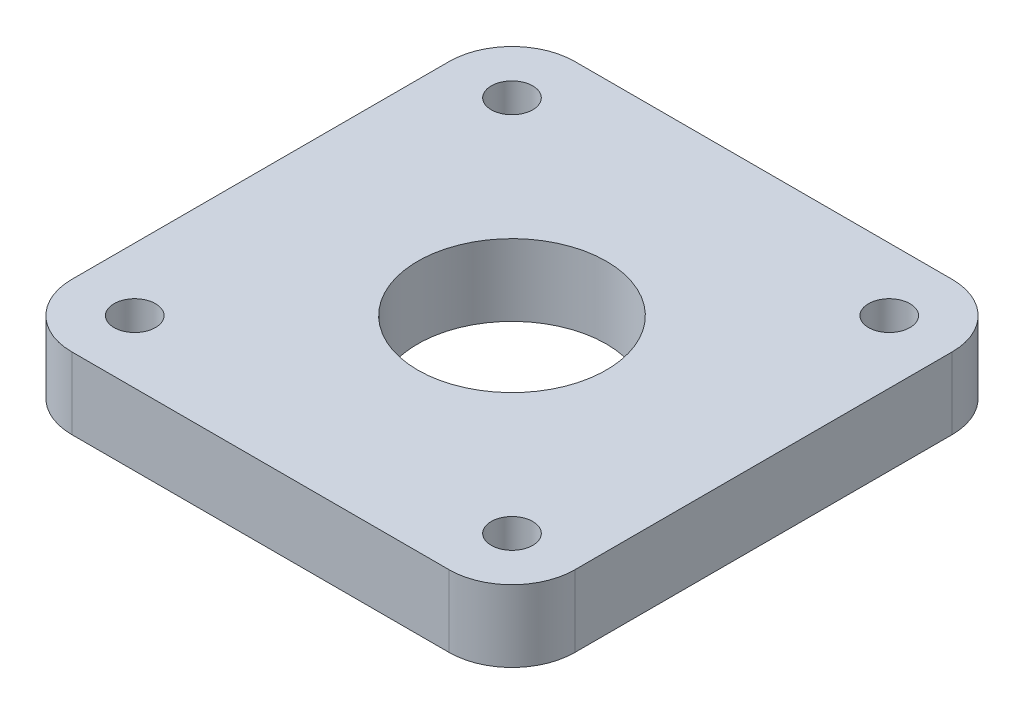
ISO-10303-21;
HEADER;
FILE_DESCRIPTION(('STEP AP214'),'2;1');
FILE_NAME('part.step','',(''),(''),'','','');
FILE_SCHEMA(('AUTOMOTIVE_DESIGN { 1 0 10303 214 1 1 1 1 }'));
ENDSEC;
DATA;
#1=APPLICATION_CONTEXT('core data for automotive mechanical design processes');
#2=APPLICATION_PROTOCOL_DEFINITION('international standard','automotive_design',2000,#1);
#3=PRODUCT_CONTEXT('',#1,'mechanical');
#4=PRODUCT('Part','Part','',(#3));
#5=PRODUCT_RELATED_PRODUCT_CATEGORY('part','',(#4));
#6=PRODUCT_DEFINITION_FORMATION('','',#4);
#7=PRODUCT_DEFINITION_CONTEXT('part definition',#1,'design');
#8=PRODUCT_DEFINITION('design','',#6,#7);
#9=PRODUCT_DEFINITION_SHAPE('','',#8);
#10=(LENGTH_UNIT() NAMED_UNIT(*) SI_UNIT(.MILLI.,.METRE.));
#11=(NAMED_UNIT(*) PLANE_ANGLE_UNIT() SI_UNIT($,.RADIAN.));
#12=(NAMED_UNIT(*) SI_UNIT($,.STERADIAN.) SOLID_ANGLE_UNIT());
#13=UNCERTAINTY_MEASURE_WITH_UNIT(LENGTH_MEASURE(1.E-05),#10,'distance_accuracy_value','');
#14=(GEOMETRIC_REPRESENTATION_CONTEXT(3) GLOBAL_UNCERTAINTY_ASSIGNED_CONTEXT((#13)) GLOBAL_UNIT_ASSIGNED_CONTEXT((#10,
#11,#12)) REPRESENTATION_CONTEXT('',''));
#15=CARTESIAN_POINT('',(0.,0.,0.));
#16=DIRECTION('',(0.,0.,1.));
#17=DIRECTION('',(1.,0.,0.));
#18=AXIS2_PLACEMENT_3D('',#15,#16,#17);
#19=CARTESIAN_POINT('',(15.,5.7,15.));
#20=DIRECTION('',(0.,-1.,0.));
#21=DIRECTION('',(0.,0.,-1.));
#22=AXIS2_PLACEMENT_3D('',#19,#20,#21);
#23=CYLINDRICAL_SURFACE('',#22,5.);
#24=CARTESIAN_POINT('',(15.,0.,15.));
#25=DIRECTION('',(0.,1.,0.));
#26=DIRECTION('',(0.,0.,1.));
#27=AXIS2_PLACEMENT_3D('',#24,#25,#26);
#28=CIRCLE('',#27,5.);
#29=CARTESIAN_POINT('',(15.,0.,20.));
#30=VERTEX_POINT('',#29);
#31=CARTESIAN_POINT('',(20.,0.,15.));
#32=VERTEX_POINT('',#31);
#33=EDGE_CURVE('E141',#30,#32,#28,.T.);
#34=ORIENTED_EDGE('',*,*,#33,.T.);
#35=DIRECTION('',(0.,-1.,0.));
#36=VECTOR('',#35,1.);
#37=CARTESIAN_POINT('',(20.,5.7,15.));
#38=LINE('',#37,#36);
#39=CARTESIAN_POINT('',(20.,5.7,15.));
#40=VERTEX_POINT('',#39);
#41=EDGE_CURVE('E11',#40,#32,#38,.T.);
#42=ORIENTED_EDGE('',*,*,#41,.F.);
#43=CARTESIAN_POINT('',(15.,5.7,15.));
#44=DIRECTION('',(0.,1.,0.));
#45=DIRECTION('',(0.,0.,1.));
#46=AXIS2_PLACEMENT_3D('',#43,#44,#45);
#47=CIRCLE('',#46,5.);
#48=CARTESIAN_POINT('',(15.,5.7,20.));
#49=VERTEX_POINT('',#48);
#50=EDGE_CURVE('E164',#49,#40,#47,.T.);
#51=ORIENTED_EDGE('',*,*,#50,.F.);
#52=DIRECTION('',(0.,-1.,0.));
#53=VECTOR('',#52,1.);
#54=CARTESIAN_POINT('',(15.,5.7,20.));
#55=LINE('',#54,#53);
#56=EDGE_CURVE('E137',#49,#30,#55,.T.);
#57=ORIENTED_EDGE('',*,*,#56,.T.);
#58=EDGE_LOOP('',(#34,#42,#51,#57));
#59=FACE_BOUND('',#58,.T.);
#60=ADVANCED_FACE('F39',(#59),#23,.T.);
#61=CARTESIAN_POINT('',(20.,5.7,15.));
#62=DIRECTION('',(-1.,0.,0.));
#63=DIRECTION('',(0.,0.,1.));
#64=AXIS2_PLACEMENT_3D('',#61,#62,#63);
#65=PLANE('',#64);
#66=DIRECTION('',(0.,0.,-1.));
#67=VECTOR('',#66,1.);
#68=CARTESIAN_POINT('',(20.,0.,15.));
#69=LINE('',#68,#67);
#70=CARTESIAN_POINT('',(20.,0.,-15.));
#71=VERTEX_POINT('',#70);
#72=EDGE_CURVE('E145',#32,#71,#69,.T.);
#73=ORIENTED_EDGE('',*,*,#72,.T.);
#74=DIRECTION('',(0.,-1.,0.));
#75=VECTOR('',#74,1.);
#76=CARTESIAN_POINT('',(20.,5.7,-15.));
#77=LINE('',#76,#75);
#78=CARTESIAN_POINT('',(20.,5.7,-15.));
#79=VERTEX_POINT('',#78);
#80=EDGE_CURVE('E48',#79,#71,#77,.T.);
#81=ORIENTED_EDGE('',*,*,#80,.F.);
#82=DIRECTION('',(0.,0.,-1.));
#83=VECTOR('',#82,1.);
#84=CARTESIAN_POINT('',(20.,5.7,15.));
#85=LINE('',#84,#83);
#86=EDGE_CURVE('E99',#40,#79,#85,.T.);
#87=ORIENTED_EDGE('',*,*,#86,.F.);
#88=ORIENTED_EDGE('',*,*,#41,.T.);
#89=EDGE_LOOP('',(#73,#81,#87,#88));
#90=FACE_BOUND('',#89,.T.);
#91=ADVANCED_FACE('F276',(#90),#65,.F.);
#92=CARTESIAN_POINT('',(15.,5.7,-15.));
#93=DIRECTION('',(0.,-1.,0.));
#94=DIRECTION('',(0.,0.,-1.));
#95=AXIS2_PLACEMENT_3D('',#92,#93,#94);
#96=CYLINDRICAL_SURFACE('',#95,5.);
#97=CARTESIAN_POINT('',(15.,0.,-15.));
#98=DIRECTION('',(0.,1.,0.));
#99=DIRECTION('',(0.,0.,-1.));
#100=AXIS2_PLACEMENT_3D('',#97,#98,#99);
#101=CIRCLE('',#100,5.);
#102=CARTESIAN_POINT('',(15.,0.,-20.));
#103=VERTEX_POINT('',#102);
#104=EDGE_CURVE('E149',#71,#103,#101,.T.);
#105=ORIENTED_EDGE('',*,*,#104,.T.);
#106=DIRECTION('',(0.,-1.,0.));
#107=VECTOR('',#106,1.);
#108=CARTESIAN_POINT('',(15.,5.7,-20.));
#109=LINE('',#108,#107);
#110=CARTESIAN_POINT('',(15.,5.7,-20.));
#111=VERTEX_POINT('',#110);
#112=EDGE_CURVE('E175',#111,#103,#109,.T.);
#113=ORIENTED_EDGE('',*,*,#112,.F.);
#114=CARTESIAN_POINT('',(15.,5.7,-15.));
#115=DIRECTION('',(0.,1.,0.));
#116=DIRECTION('',(0.,0.,-1.));
#117=AXIS2_PLACEMENT_3D('',#114,#115,#116);
#118=CIRCLE('',#117,5.);
#119=EDGE_CURVE('E186',#79,#111,#118,.T.);
#120=ORIENTED_EDGE('',*,*,#119,.F.);
#121=ORIENTED_EDGE('',*,*,#80,.T.);
#122=EDGE_LOOP('',(#105,#113,#120,#121));
#123=FACE_BOUND('',#122,.T.);
#124=ADVANCED_FACE('F184',(#123),#96,.T.);
#125=CARTESIAN_POINT('',(-15.,5.7,-20.));
#126=DIRECTION('',(0.,0.,1.));
#127=DIRECTION('',(1.,0.,0.));
#128=AXIS2_PLACEMENT_3D('',#125,#126,#127);
#129=PLANE('',#128);
#130=DIRECTION('',(-1.,0.,0.));
#131=VECTOR('',#130,1.);
#132=CARTESIAN_POINT('',(-15.,0.,-20.));
#133=LINE('',#132,#131);
#134=CARTESIAN_POINT('',(-15.,0.,-20.));
#135=VERTEX_POINT('',#134);
#136=EDGE_CURVE('E152',#103,#135,#133,.T.);
#137=ORIENTED_EDGE('',*,*,#136,.T.);
#138=DIRECTION('',(0.,-1.,0.));
#139=VECTOR('',#138,1.);
#140=CARTESIAN_POINT('',(-15.,5.7,-20.));
#141=LINE('',#140,#139);
#142=CARTESIAN_POINT('',(-15.,5.7,-20.));
#143=VERTEX_POINT('',#142);
#144=EDGE_CURVE('E171',#143,#135,#141,.T.);
#145=ORIENTED_EDGE('',*,*,#144,.F.);
#146=DIRECTION('',(-1.,0.,0.));
#147=VECTOR('',#146,1.);
#148=CARTESIAN_POINT('',(-15.,5.7,-20.));
#149=LINE('',#148,#147);
#150=EDGE_CURVE('E199',#111,#143,#149,.T.);
#151=ORIENTED_EDGE('',*,*,#150,.F.);
#152=ORIENTED_EDGE('',*,*,#112,.T.);
#153=EDGE_LOOP('',(#137,#145,#151,#152));
#154=FACE_BOUND('',#153,.T.);
#155=ADVANCED_FACE('F194',(#154),#129,.F.);
#156=CARTESIAN_POINT('',(-15.,5.7,-15.));
#157=DIRECTION('',(0.,-1.,0.));
#158=DIRECTION('',(0.,0.,-1.));
#159=AXIS2_PLACEMENT_3D('',#156,#157,#158);
#160=CYLINDRICAL_SURFACE('',#159,5.);
#161=CARTESIAN_POINT('',(-15.,0.,-15.));
#162=DIRECTION('',(0.,1.,0.));
#163=DIRECTION('',(0.,0.,-1.));
#164=AXIS2_PLACEMENT_3D('',#161,#162,#163);
#165=CIRCLE('',#164,5.);
#166=CARTESIAN_POINT('',(-20.,0.,-15.));
#167=VERTEX_POINT('',#166);
#168=EDGE_CURVE('E155',#135,#167,#165,.T.);
#169=ORIENTED_EDGE('',*,*,#168,.T.);
#170=DIRECTION('',(0.,-1.,0.));
#171=VECTOR('',#170,1.);
#172=CARTESIAN_POINT('',(-20.,5.7,-15.));
#173=LINE('',#172,#171);
#174=CARTESIAN_POINT('',(-20.,5.7,-15.));
#175=VERTEX_POINT('',#174);
#176=EDGE_CURVE('E129',#175,#167,#173,.T.);
#177=ORIENTED_EDGE('',*,*,#176,.F.);
#178=CARTESIAN_POINT('',(-15.,5.7,-15.));
#179=DIRECTION('',(0.,1.,0.));
#180=DIRECTION('',(0.,0.,-1.));
#181=AXIS2_PLACEMENT_3D('',#178,#179,#180);
#182=CIRCLE('',#181,5.);
#183=EDGE_CURVE('E118',#143,#175,#182,.T.);
#184=ORIENTED_EDGE('',*,*,#183,.F.);
#185=ORIENTED_EDGE('',*,*,#144,.T.);
#186=EDGE_LOOP('',(#169,#177,#184,#185));
#187=FACE_BOUND('',#186,.T.);
#188=ADVANCED_FACE('F197',(#187),#160,.T.);
#189=CARTESIAN_POINT('',(-20.,5.7,15.));
#190=DIRECTION('',(1.,0.,0.));
#191=DIRECTION('',(0.,0.,-1.));
#192=AXIS2_PLACEMENT_3D('',#189,#190,#191);
#193=PLANE('',#192);
#194=DIRECTION('',(0.,0.,1.));
#195=VECTOR('',#194,1.);
#196=CARTESIAN_POINT('',(-20.,0.,15.));
#197=LINE('',#196,#195);
#198=CARTESIAN_POINT('',(-20.,0.,15.));
#199=VERTEX_POINT('',#198);
#200=EDGE_CURVE('E127',#167,#199,#197,.T.);
#201=ORIENTED_EDGE('',*,*,#200,.T.);
#202=DIRECTION('',(0.,-1.,0.));
#203=VECTOR('',#202,1.);
#204=CARTESIAN_POINT('',(-20.,5.7,15.));
#205=LINE('',#204,#203);
#206=CARTESIAN_POINT('',(-20.,5.7,15.));
#207=VERTEX_POINT('',#206);
#208=EDGE_CURVE('E124',#207,#199,#205,.T.);
#209=ORIENTED_EDGE('',*,*,#208,.F.);
#210=DIRECTION('',(0.,0.,1.));
#211=VECTOR('',#210,1.);
#212=CARTESIAN_POINT('',(-20.,5.7,15.));
#213=LINE('',#212,#211);
#214=EDGE_CURVE('E112',#175,#207,#213,.T.);
#215=ORIENTED_EDGE('',*,*,#214,.F.);
#216=ORIENTED_EDGE('',*,*,#176,.T.);
#217=EDGE_LOOP('',(#201,#209,#215,#216));
#218=FACE_BOUND('',#217,.T.);
#219=ADVANCED_FACE('F125',(#218),#193,.F.);
#220=CARTESIAN_POINT('',(-15.,5.7,15.));
#221=DIRECTION('',(0.,-1.,0.));
#222=DIRECTION('',(0.,0.,-1.));
#223=AXIS2_PLACEMENT_3D('',#220,#221,#222);
#224=CYLINDRICAL_SURFACE('',#223,5.);
#225=CARTESIAN_POINT('',(-15.,0.,15.));
#226=DIRECTION('',(0.,1.,0.));
#227=DIRECTION('',(0.,0.,-1.));
#228=AXIS2_PLACEMENT_3D('',#225,#226,#227);
#229=CIRCLE('',#228,5.);
#230=CARTESIAN_POINT('',(-15.,0.,20.));
#231=VERTEX_POINT('',#230);
#232=EDGE_CURVE('E85',#199,#231,#229,.T.);
#233=ORIENTED_EDGE('',*,*,#232,.T.);
#234=DIRECTION('',(0.,-1.,0.));
#235=VECTOR('',#234,1.);
#236=CARTESIAN_POINT('',(-15.,5.7,20.));
#237=LINE('',#236,#235);
#238=CARTESIAN_POINT('',(-15.,5.7,20.));
#239=VERTEX_POINT('',#238);
#240=EDGE_CURVE('E130',#239,#231,#237,.T.);
#241=ORIENTED_EDGE('',*,*,#240,.F.);
#242=CARTESIAN_POINT('',(-15.,5.7,15.));
#243=DIRECTION('',(0.,1.,0.));
#244=DIRECTION('',(0.,0.,-1.));
#245=AXIS2_PLACEMENT_3D('',#242,#243,#244);
#246=CIRCLE('',#245,5.);
#247=EDGE_CURVE('E116',#207,#239,#246,.T.);
#248=ORIENTED_EDGE('',*,*,#247,.F.);
#249=ORIENTED_EDGE('',*,*,#208,.T.);
#250=EDGE_LOOP('',(#233,#241,#248,#249));
#251=FACE_BOUND('',#250,.T.);
#252=ADVANCED_FACE('F132',(#251),#224,.T.);
#253=CARTESIAN_POINT('',(-15.,5.7,20.));
#254=DIRECTION('',(0.,0.,-1.));
#255=DIRECTION('',(-1.,0.,0.));
#256=AXIS2_PLACEMENT_3D('',#253,#254,#255);
#257=PLANE('',#256);
#258=DIRECTION('',(1.,0.,0.));
#259=VECTOR('',#258,1.);
#260=CARTESIAN_POINT('',(-15.,0.,20.));
#261=LINE('',#260,#259);
#262=EDGE_CURVE('E91',#231,#30,#261,.T.);
#263=ORIENTED_EDGE('',*,*,#262,.T.);
#264=ORIENTED_EDGE('',*,*,#56,.F.);
#265=DIRECTION('',(1.,0.,0.));
#266=VECTOR('',#265,1.);
#267=CARTESIAN_POINT('',(-15.,5.7,20.));
#268=LINE('',#267,#266);
#269=EDGE_CURVE('E56',#239,#49,#268,.T.);
#270=ORIENTED_EDGE('',*,*,#269,.F.);
#271=ORIENTED_EDGE('',*,*,#240,.T.);
#272=EDGE_LOOP('',(#263,#264,#270,#271));
#273=FACE_BOUND('',#272,.T.);
#274=ADVANCED_FACE('F255',(#273),#257,.F.);
#275=CARTESIAN_POINT('',(15.,5.7,15.));
#276=DIRECTION('',(0.,1.,0.));
#277=DIRECTION('',(0.,0.,1.));
#278=AXIS2_PLACEMENT_3D('',#275,#276,#277);
#279=PLANE('',#278);
#280=CARTESIAN_POINT('',(-15.,5.7,15.));
#281=DIRECTION('',(0.,1.,0.));
#282=DIRECTION('',(0.,0.,-1.));
#283=AXIS2_PLACEMENT_3D('',#280,#281,#282);
#284=CIRCLE('',#283,1.65);
#285=CARTESIAN_POINT('',(-15.,5.7,13.35));
#286=VERTEX_POINT('',#285);
#287=EDGE_CURVE('E222',#286,#286,#284,.T.);
#288=ORIENTED_EDGE('',*,*,#287,.F.);
#289=EDGE_LOOP('',(#288));
#290=FACE_BOUND('',#289,.T.);
#291=CARTESIAN_POINT('',(15.,5.7,15.));
#292=DIRECTION('',(0.,1.,0.));
#293=DIRECTION('',(0.,0.,1.));
#294=AXIS2_PLACEMENT_3D('',#291,#292,#293);
#295=CIRCLE('',#294,1.65);
#296=CARTESIAN_POINT('',(15.,5.7,16.65));
#297=VERTEX_POINT('',#296);
#298=EDGE_CURVE('E230',#297,#297,#295,.T.);
#299=ORIENTED_EDGE('',*,*,#298,.F.);
#300=EDGE_LOOP('',(#299));
#301=FACE_BOUND('',#300,.T.);
#302=CARTESIAN_POINT('',(15.,5.7,-15.));
#303=DIRECTION('',(0.,1.,0.));
#304=DIRECTION('',(0.,0.,-1.));
#305=AXIS2_PLACEMENT_3D('',#302,#303,#304);
#306=CIRCLE('',#305,1.65);
#307=CARTESIAN_POINT('',(15.,5.7,-16.65));
#308=VERTEX_POINT('',#307);
#309=EDGE_CURVE('E238',#308,#308,#306,.T.);
#310=ORIENTED_EDGE('',*,*,#309,.F.);
#311=EDGE_LOOP('',(#310));
#312=FACE_BOUND('',#311,.T.);
#313=CARTESIAN_POINT('',(-15.,5.7,-15.));
#314=DIRECTION('',(0.,1.,0.));
#315=DIRECTION('',(0.,0.,1.));
#316=AXIS2_PLACEMENT_3D('',#313,#314,#315);
#317=CIRCLE('',#316,1.65);
#318=CARTESIAN_POINT('',(-15.,5.7,-13.35));
#319=VERTEX_POINT('',#318);
#320=EDGE_CURVE('E214',#319,#319,#317,.T.);
#321=ORIENTED_EDGE('',*,*,#320,.F.);
#322=EDGE_LOOP('',(#321));
#323=FACE_BOUND('',#322,.T.);
#324=CARTESIAN_POINT('',(0.,5.7,0.));
#325=DIRECTION('',(0.,1.,0.));
#326=DIRECTION('',(0.,0.,1.));
#327=AXIS2_PLACEMENT_3D('',#324,#325,#326);
#328=CIRCLE('',#327,7.5);
#329=CARTESIAN_POINT('',(0.,5.7,7.5));
#330=VERTEX_POINT('',#329);
#331=EDGE_CURVE('E210',#330,#330,#328,.T.);
#332=ORIENTED_EDGE('',*,*,#331,.F.);
#333=EDGE_LOOP('',(#332));
#334=FACE_BOUND('',#333,.T.);
#335=ORIENTED_EDGE('',*,*,#50,.T.);
#336=ORIENTED_EDGE('',*,*,#86,.T.);
#337=ORIENTED_EDGE('',*,*,#119,.T.);
#338=ORIENTED_EDGE('',*,*,#150,.T.);
#339=ORIENTED_EDGE('',*,*,#183,.T.);
#340=ORIENTED_EDGE('',*,*,#214,.T.);
#341=ORIENTED_EDGE('',*,*,#247,.T.);
#342=ORIENTED_EDGE('',*,*,#269,.T.);
#343=EDGE_LOOP('',(#335,#336,#337,#338,#339,#340,#341,#342));
#344=FACE_BOUND('',#343,.T.);
#345=ADVANCED_FACE('F114',(#290,#301,#312,#323,#334,#344),#279,.T.);
#346=CARTESIAN_POINT('',(15.,0.,15.));
#347=DIRECTION('',(0.,1.,0.));
#348=DIRECTION('',(0.,0.,1.));
#349=AXIS2_PLACEMENT_3D('',#346,#347,#348);
#350=PLANE('',#349);
#351=CARTESIAN_POINT('',(-15.,0.,15.));
#352=DIRECTION('',(0.,1.,0.));
#353=DIRECTION('',(0.,0.,-1.));
#354=AXIS2_PLACEMENT_3D('',#351,#352,#353);
#355=CIRCLE('',#354,1.65);
#356=CARTESIAN_POINT('',(-15.,0.,13.35));
#357=VERTEX_POINT('',#356);
#358=EDGE_CURVE('E218',#357,#357,#355,.T.);
#359=ORIENTED_EDGE('',*,*,#358,.T.);
#360=EDGE_LOOP('',(#359));
#361=FACE_BOUND('',#360,.T.);
#362=CARTESIAN_POINT('',(15.,0.,15.));
#363=DIRECTION('',(0.,1.,0.));
#364=DIRECTION('',(0.,0.,1.));
#365=AXIS2_PLACEMENT_3D('',#362,#363,#364);
#366=CIRCLE('',#365,1.65);
#367=CARTESIAN_POINT('',(15.,0.,16.65));
#368=VERTEX_POINT('',#367);
#369=EDGE_CURVE('E226',#368,#368,#366,.T.);
#370=ORIENTED_EDGE('',*,*,#369,.T.);
#371=EDGE_LOOP('',(#370));
#372=FACE_BOUND('',#371,.T.);
#373=CARTESIAN_POINT('',(15.,0.,-15.));
#374=DIRECTION('',(0.,1.,0.));
#375=DIRECTION('',(0.,0.,-1.));
#376=AXIS2_PLACEMENT_3D('',#373,#374,#375);
#377=CIRCLE('',#376,1.65);
#378=CARTESIAN_POINT('',(15.,0.,-16.65));
#379=VERTEX_POINT('',#378);
#380=EDGE_CURVE('E234',#379,#379,#377,.T.);
#381=ORIENTED_EDGE('',*,*,#380,.T.);
#382=EDGE_LOOP('',(#381));
#383=FACE_BOUND('',#382,.T.);
#384=CARTESIAN_POINT('',(-15.,0.,-15.));
#385=DIRECTION('',(0.,1.,0.));
#386=DIRECTION('',(0.,0.,1.));
#387=AXIS2_PLACEMENT_3D('',#384,#385,#386);
#388=CIRCLE('',#387,1.65);
#389=CARTESIAN_POINT('',(-15.,0.,-13.35));
#390=VERTEX_POINT('',#389);
#391=EDGE_CURVE('E242',#390,#390,#388,.T.);
#392=ORIENTED_EDGE('',*,*,#391,.T.);
#393=EDGE_LOOP('',(#392));
#394=FACE_BOUND('',#393,.T.);
#395=CARTESIAN_POINT('',(0.,0.,0.));
#396=DIRECTION('',(0.,1.,0.));
#397=DIRECTION('',(0.,0.,1.));
#398=AXIS2_PLACEMENT_3D('',#395,#396,#397);
#399=CIRCLE('',#398,7.5);
#400=CARTESIAN_POINT('',(0.,0.,7.5));
#401=VERTEX_POINT('',#400);
#402=EDGE_CURVE('E146',#401,#401,#399,.T.);
#403=ORIENTED_EDGE('',*,*,#402,.T.);
#404=EDGE_LOOP('',(#403));
#405=FACE_BOUND('',#404,.T.);
#406=ORIENTED_EDGE('',*,*,#33,.F.);
#407=ORIENTED_EDGE('',*,*,#262,.F.);
#408=ORIENTED_EDGE('',*,*,#232,.F.);
#409=ORIENTED_EDGE('',*,*,#200,.F.);
#410=ORIENTED_EDGE('',*,*,#168,.F.);
#411=ORIENTED_EDGE('',*,*,#136,.F.);
#412=ORIENTED_EDGE('',*,*,#104,.F.);
#413=ORIENTED_EDGE('',*,*,#72,.F.);
#414=EDGE_LOOP('',(#406,#407,#408,#409,#410,#411,#412,#413));
#415=FACE_BOUND('',#414,.T.);
#416=ADVANCED_FACE('F190',(#361,#372,#383,#394,#405,#415),#350,.F.);
#417=CARTESIAN_POINT('',(0.,0.,0.));
#418=DIRECTION('',(0.,1.,0.));
#419=DIRECTION('',(0.,0.,1.));
#420=AXIS2_PLACEMENT_3D('',#417,#418,#419);
#421=CYLINDRICAL_SURFACE('',#420,7.5);
#422=ORIENTED_EDGE('',*,*,#402,.F.);
#423=EDGE_LOOP('',(#422));
#424=FACE_BOUND('',#423,.T.);
#425=ORIENTED_EDGE('',*,*,#331,.T.);
#426=EDGE_LOOP('',(#425));
#427=FACE_BOUND('',#426,.T.);
#428=ADVANCED_FACE('F260',(#424,#427),#421,.F.);
#429=CARTESIAN_POINT('',(-15.,0.,-15.));
#430=DIRECTION('',(0.,1.,0.));
#431=DIRECTION('',(0.,0.,1.));
#432=AXIS2_PLACEMENT_3D('',#429,#430,#431);
#433=CYLINDRICAL_SURFACE('',#432,1.65);
#434=ORIENTED_EDGE('',*,*,#391,.F.);
#435=EDGE_LOOP('',(#434));
#436=FACE_BOUND('',#435,.T.);
#437=ORIENTED_EDGE('',*,*,#320,.T.);
#438=EDGE_LOOP('',(#437));
#439=FACE_BOUND('',#438,.T.);
#440=ADVANCED_FACE('F251',(#436,#439),#433,.F.);
#441=CARTESIAN_POINT('',(15.,0.,-15.));
#442=DIRECTION('',(0.,1.,0.));
#443=DIRECTION('',(0.,0.,1.));
#444=AXIS2_PLACEMENT_3D('',#441,#442,#443);
#445=CYLINDRICAL_SURFACE('',#444,1.65);
#446=ORIENTED_EDGE('',*,*,#380,.F.);
#447=EDGE_LOOP('',(#446));
#448=FACE_BOUND('',#447,.T.);
#449=ORIENTED_EDGE('',*,*,#309,.T.);
#450=EDGE_LOOP('',(#449));
#451=FACE_BOUND('',#450,.T.);
#452=ADVANCED_FACE('F268',(#448,#451),#445,.F.);
#453=CARTESIAN_POINT('',(15.,0.,15.));
#454=DIRECTION('',(0.,1.,0.));
#455=DIRECTION('',(0.,0.,1.));
#456=AXIS2_PLACEMENT_3D('',#453,#454,#455);
#457=CYLINDRICAL_SURFACE('',#456,1.65);
#458=ORIENTED_EDGE('',*,*,#369,.F.);
#459=EDGE_LOOP('',(#458));
#460=FACE_BOUND('',#459,.T.);
#461=ORIENTED_EDGE('',*,*,#298,.T.);
#462=EDGE_LOOP('',(#461));
#463=FACE_BOUND('',#462,.T.);
#464=ADVANCED_FACE('F358',(#460,#463),#457,.F.);
#465=CARTESIAN_POINT('',(-15.,0.,15.));
#466=DIRECTION('',(0.,1.,0.));
#467=DIRECTION('',(0.,0.,1.));
#468=AXIS2_PLACEMENT_3D('',#465,#466,#467);
#469=CYLINDRICAL_SURFACE('',#468,1.65);
#470=ORIENTED_EDGE('',*,*,#358,.F.);
#471=EDGE_LOOP('',(#470));
#472=FACE_BOUND('',#471,.T.);
#473=ORIENTED_EDGE('',*,*,#287,.T.);
#474=EDGE_LOOP('',(#473));
#475=FACE_BOUND('',#474,.T.);
#476=ADVANCED_FACE('F369',(#472,#475),#469,.F.);
#477=CLOSED_SHELL('',(#60,#91,#124,#155,#188,#219,#252,#274,#345,#416,#428,#440,#452,#464,#476));
#478=MANIFOLD_SOLID_BREP('B2',#477);
#479=ADVANCED_BREP_SHAPE_REPRESENTATION('',(#18,#478),#14);
#480=SHAPE_DEFINITION_REPRESENTATION(#9,#479);
ENDSEC;
END-ISO-10303-21;
